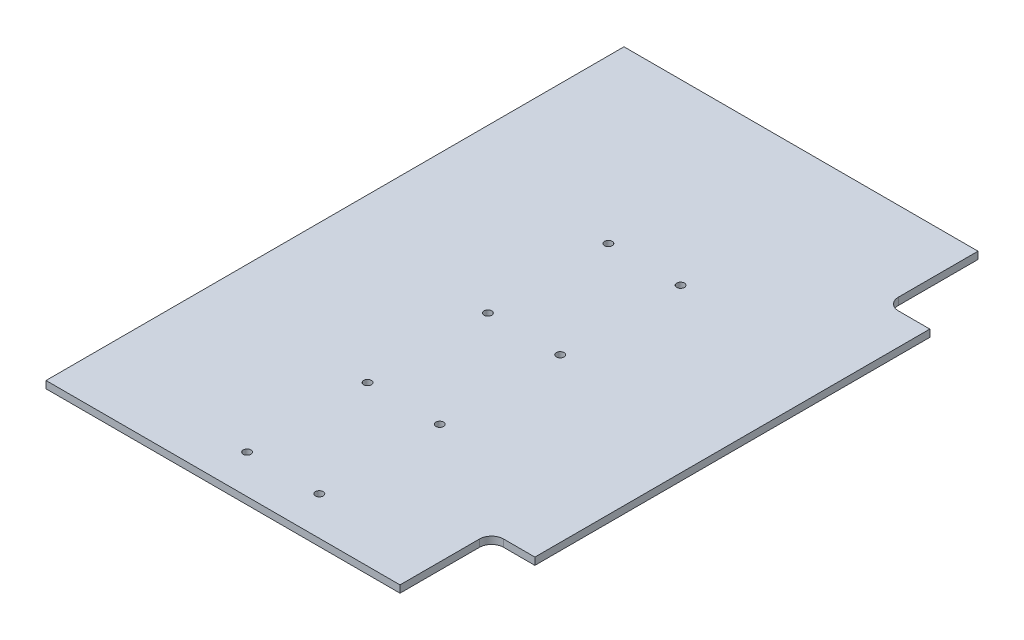
ISO-10303-21;
HEADER;
FILE_DESCRIPTION(('STEP AP214'),'2;1');
FILE_NAME('part.step','',(''),(''),'','','');
FILE_SCHEMA(('AUTOMOTIVE_DESIGN { 1 0 10303 214 1 1 1 1 }'));
ENDSEC;
DATA;
#1=APPLICATION_CONTEXT('core data for automotive mechanical design processes');
#2=APPLICATION_PROTOCOL_DEFINITION('international standard','automotive_design',2000,#1);
#3=PRODUCT_CONTEXT('',#1,'mechanical');
#4=PRODUCT('Part','Part','',(#3));
#5=PRODUCT_RELATED_PRODUCT_CATEGORY('part','',(#4));
#6=PRODUCT_DEFINITION_FORMATION('','',#4);
#7=PRODUCT_DEFINITION_CONTEXT('part definition',#1,'design');
#8=PRODUCT_DEFINITION('design','',#6,#7);
#9=PRODUCT_DEFINITION_SHAPE('','',#8);
#10=(LENGTH_UNIT() NAMED_UNIT(*) SI_UNIT(.MILLI.,.METRE.));
#11=(NAMED_UNIT(*) PLANE_ANGLE_UNIT() SI_UNIT($,.RADIAN.));
#12=(NAMED_UNIT(*) SI_UNIT($,.STERADIAN.) SOLID_ANGLE_UNIT());
#13=UNCERTAINTY_MEASURE_WITH_UNIT(LENGTH_MEASURE(1.E-05),#10,'distance_accuracy_value','');
#14=(GEOMETRIC_REPRESENTATION_CONTEXT(3) GLOBAL_UNCERTAINTY_ASSIGNED_CONTEXT((#13)) GLOBAL_UNIT_ASSIGNED_CONTEXT((#10,
#11,#12)) REPRESENTATION_CONTEXT('',''));
#15=CARTESIAN_POINT('',(0.,0.,0.));
#16=DIRECTION('',(0.,0.,1.));
#17=DIRECTION('',(1.,0.,0.));
#18=AXIS2_PLACEMENT_3D('',#15,#16,#17);
#19=CARTESIAN_POINT('',(82.5,3.,-120.));
#20=DIRECTION('',(-1.,0.,0.));
#21=DIRECTION('',(0.,0.,1.));
#22=AXIS2_PLACEMENT_3D('',#19,#20,#21);
#23=PLANE('',#22);
#24=DIRECTION('',(0.,0.,-1.));
#25=VECTOR('',#24,1.);
#26=CARTESIAN_POINT('',(82.5,0.,-120.));
#27=LINE('',#26,#25);
#28=CARTESIAN_POINT('',(82.4999999999999,0.,82.));
#29=VERTEX_POINT('',#28);
#30=CARTESIAN_POINT('',(82.5,0.,-82.));
#31=VERTEX_POINT('',#30);
#32=EDGE_CURVE('E140',#29,#31,#27,.T.);
#33=ORIENTED_EDGE('',*,*,#32,.T.);
#34=DIRECTION('',(0.,1.,0.));
#35=VECTOR('',#34,1.);
#36=CARTESIAN_POINT('',(82.5,-8.,-82.));
#37=LINE('',#36,#35);
#38=CARTESIAN_POINT('',(82.5,3.,-82.));
#39=VERTEX_POINT('',#38);
#40=EDGE_CURVE('E114',#31,#39,#37,.T.);
#41=ORIENTED_EDGE('',*,*,#40,.T.);
#42=DIRECTION('',(0.,0.,-1.));
#43=VECTOR('',#42,1.);
#44=CARTESIAN_POINT('',(82.5,3.,-120.));
#45=LINE('',#44,#43);
#46=CARTESIAN_POINT('',(82.4999999999999,3.,82.));
#47=VERTEX_POINT('',#46);
#48=EDGE_CURVE('E128',#47,#39,#45,.T.);
#49=ORIENTED_EDGE('',*,*,#48,.F.);
#50=DIRECTION('',(0.,1.,0.));
#51=VECTOR('',#50,1.);
#52=CARTESIAN_POINT('',(82.4999999999999,-8.,82.));
#53=LINE('',#52,#51);
#54=EDGE_CURVE('E220',#29,#47,#53,.T.);
#55=ORIENTED_EDGE('',*,*,#54,.F.);
#56=EDGE_LOOP('',(#33,#41,#49,#55));
#57=FACE_BOUND('',#56,.T.);
#58=ADVANCED_FACE('F33',(#57),#23,.F.);
#59=CARTESIAN_POINT('',(-82.5,3.,-120.));
#60=DIRECTION('',(0.,0.,1.));
#61=DIRECTION('',(1.,0.,0.));
#62=AXIS2_PLACEMENT_3D('',#59,#60,#61);
#63=PLANE('',#62);
#64=DIRECTION('',(-1.,0.,0.));
#65=VECTOR('',#64,1.);
#66=CARTESIAN_POINT('',(-82.5,3.,-120.));
#67=LINE('',#66,#65);
#68=CARTESIAN_POINT('',(64.5,3.,-120.));
#69=VERTEX_POINT('',#68);
#70=CARTESIAN_POINT('',(-82.5,3.,-120.));
#71=VERTEX_POINT('',#70);
#72=EDGE_CURVE('E119',#69,#71,#67,.T.);
#73=ORIENTED_EDGE('',*,*,#72,.F.);
#74=DIRECTION('',(0.,1.,0.));
#75=VECTOR('',#74,1.);
#76=CARTESIAN_POINT('',(64.5,-8.,-120.));
#77=LINE('',#76,#75);
#78=CARTESIAN_POINT('',(64.5,0.,-120.));
#79=VERTEX_POINT('',#78);
#80=EDGE_CURVE('E107',#79,#69,#77,.T.);
#81=ORIENTED_EDGE('',*,*,#80,.F.);
#82=DIRECTION('',(-1.,0.,0.));
#83=VECTOR('',#82,1.);
#84=CARTESIAN_POINT('',(-82.5,0.,-120.));
#85=LINE('',#84,#83);
#86=CARTESIAN_POINT('',(-82.5,0.,-120.));
#87=VERTEX_POINT('',#86);
#88=EDGE_CURVE('E143',#79,#87,#85,.T.);
#89=ORIENTED_EDGE('',*,*,#88,.T.);
#90=DIRECTION('',(0.,-1.,0.));
#91=VECTOR('',#90,1.);
#92=CARTESIAN_POINT('',(-82.5,3.,-120.));
#93=LINE('',#92,#91);
#94=EDGE_CURVE('E125',#71,#87,#93,.T.);
#95=ORIENTED_EDGE('',*,*,#94,.F.);
#96=EDGE_LOOP('',(#73,#81,#89,#95));
#97=FACE_BOUND('',#96,.T.);
#98=ADVANCED_FACE('F123',(#97),#63,.F.);
#99=CARTESIAN_POINT('',(-82.5,3.,-120.));
#100=DIRECTION('',(1.,0.,0.));
#101=DIRECTION('',(0.,0.,-1.));
#102=AXIS2_PLACEMENT_3D('',#99,#100,#101);
#103=PLANE('',#102);
#104=DIRECTION('',(0.,0.,1.));
#105=VECTOR('',#104,1.);
#106=CARTESIAN_POINT('',(-82.5,0.,-120.));
#107=LINE('',#106,#105);
#108=CARTESIAN_POINT('',(-82.5,0.,120.));
#109=VERTEX_POINT('',#108);
#110=EDGE_CURVE('E146',#87,#109,#107,.T.);
#111=ORIENTED_EDGE('',*,*,#110,.T.);
#112=DIRECTION('',(0.,-1.,0.));
#113=VECTOR('',#112,1.);
#114=CARTESIAN_POINT('',(-82.5,3.,120.));
#115=LINE('',#114,#113);
#116=CARTESIAN_POINT('',(-82.5,3.,120.));
#117=VERTEX_POINT('',#116);
#118=EDGE_CURVE('E139',#117,#109,#115,.T.);
#119=ORIENTED_EDGE('',*,*,#118,.F.);
#120=DIRECTION('',(0.,0.,1.));
#121=VECTOR('',#120,1.);
#122=CARTESIAN_POINT('',(-82.5,3.,-120.));
#123=LINE('',#122,#121);
#124=EDGE_CURVE('E127',#71,#117,#123,.T.);
#125=ORIENTED_EDGE('',*,*,#124,.F.);
#126=ORIENTED_EDGE('',*,*,#94,.T.);
#127=EDGE_LOOP('',(#111,#119,#125,#126));
#128=FACE_BOUND('',#127,.T.);
#129=ADVANCED_FACE('F262',(#128),#103,.F.);
#130=CARTESIAN_POINT('',(-82.5,3.,120.));
#131=DIRECTION('',(0.,0.,-1.));
#132=DIRECTION('',(-1.,0.,0.));
#133=AXIS2_PLACEMENT_3D('',#130,#131,#132);
#134=PLANE('',#133);
#135=DIRECTION('',(1.,0.,0.));
#136=VECTOR('',#135,1.);
#137=CARTESIAN_POINT('',(-82.5,0.,120.));
#138=LINE('',#137,#136);
#139=CARTESIAN_POINT('',(64.5,0.,120.));
#140=VERTEX_POINT('',#139);
#141=EDGE_CURVE('E133',#109,#140,#138,.T.);
#142=ORIENTED_EDGE('',*,*,#141,.T.);
#143=DIRECTION('',(0.,1.,0.));
#144=VECTOR('',#143,1.);
#145=CARTESIAN_POINT('',(64.5,-8.,120.));
#146=LINE('',#145,#144);
#147=CARTESIAN_POINT('',(64.5,3.,120.));
#148=VERTEX_POINT('',#147);
#149=EDGE_CURVE('E121',#140,#148,#146,.T.);
#150=ORIENTED_EDGE('',*,*,#149,.T.);
#151=DIRECTION('',(1.,0.,0.));
#152=VECTOR('',#151,1.);
#153=CARTESIAN_POINT('',(-82.5,3.,120.));
#154=LINE('',#153,#152);
#155=EDGE_CURVE('E130',#117,#148,#154,.T.);
#156=ORIENTED_EDGE('',*,*,#155,.F.);
#157=ORIENTED_EDGE('',*,*,#118,.T.);
#158=EDGE_LOOP('',(#142,#150,#156,#157));
#159=FACE_BOUND('',#158,.T.);
#160=ADVANCED_FACE('F254',(#159),#134,.F.);
#161=CARTESIAN_POINT('',(0.,3.,0.));
#162=DIRECTION('',(0.,1.,0.));
#163=DIRECTION('',(0.,0.,1.));
#164=AXIS2_PLACEMENT_3D('',#161,#162,#163);
#165=PLANE('',#164);
#166=DIRECTION('',(1.,0.,0.));
#167=VECTOR('',#166,1.);
#168=CARTESIAN_POINT('',(82.5,3.,-82.));
#169=LINE('',#168,#167);
#170=CARTESIAN_POINT('',(69.5,3.,-82.));
#171=VERTEX_POINT('',#170);
#172=EDGE_CURVE('E115',#171,#39,#169,.T.);
#173=ORIENTED_EDGE('',*,*,#172,.F.);
#174=CARTESIAN_POINT('',(69.5,3.,-87.));
#175=DIRECTION('',(0.,1.,0.));
#176=DIRECTION('',(0.,0.,1.));
#177=AXIS2_PLACEMENT_3D('',#174,#175,#176);
#178=CIRCLE('',#177,5.);
#179=CARTESIAN_POINT('',(64.5,3.,-87.));
#180=VERTEX_POINT('',#179);
#181=EDGE_CURVE('E41',#171,#180,#178,.F.);
#182=ORIENTED_EDGE('',*,*,#181,.T.);
#183=DIRECTION('',(0.,0.,1.));
#184=VECTOR('',#183,1.);
#185=CARTESIAN_POINT('',(64.5,3.,-120.));
#186=LINE('',#185,#184);
#187=EDGE_CURVE('E109',#69,#180,#186,.T.);
#188=ORIENTED_EDGE('',*,*,#187,.F.);
#189=ORIENTED_EDGE('',*,*,#72,.T.);
#190=ORIENTED_EDGE('',*,*,#124,.T.);
#191=ORIENTED_EDGE('',*,*,#155,.T.);
#192=DIRECTION('',(0.,0.,1.));
#193=VECTOR('',#192,1.);
#194=CARTESIAN_POINT('',(64.5,3.,120.));
#195=LINE('',#194,#193);
#196=CARTESIAN_POINT('',(64.5,3.,87.));
#197=VERTEX_POINT('',#196);
#198=EDGE_CURVE('E216',#197,#148,#195,.T.);
#199=ORIENTED_EDGE('',*,*,#198,.F.);
#200=CARTESIAN_POINT('',(69.5,3.,87.));
#201=DIRECTION('',(0.,1.,0.));
#202=DIRECTION('',(0.,0.,1.));
#203=AXIS2_PLACEMENT_3D('',#200,#201,#202);
#204=CIRCLE('',#203,5.);
#205=CARTESIAN_POINT('',(69.5,3.,82.));
#206=VERTEX_POINT('',#205);
#207=EDGE_CURVE('E194',#197,#206,#204,.F.);
#208=ORIENTED_EDGE('',*,*,#207,.T.);
#209=DIRECTION('',(-1.,0.,0.));
#210=VECTOR('',#209,1.);
#211=CARTESIAN_POINT('',(82.4999999999999,3.,82.));
#212=LINE('',#211,#210);
#213=EDGE_CURVE('E214',#47,#206,#212,.T.);
#214=ORIENTED_EDGE('',*,*,#213,.F.);
#215=ORIENTED_EDGE('',*,*,#48,.T.);
#216=EDGE_LOOP('',(#173,#182,#188,#189,#190,#191,#199,#208,#214,#215));
#217=FACE_BOUND('',#216,.T.);
#218=CARTESIAN_POINT('',(15.000000000001,3.,54.));
#219=DIRECTION('',(0.,1.,0.));
#220=DIRECTION('',(0.,0.,1.));
#221=AXIS2_PLACEMENT_3D('',#218,#219,#220);
#222=CIRCLE('',#221,1.6);
#223=CARTESIAN_POINT('',(15.000000000001,3.,55.6));
#224=VERTEX_POINT('',#223);
#225=EDGE_CURVE('E234',#224,#224,#222,.T.);
#226=ORIENTED_EDGE('',*,*,#225,.F.);
#227=EDGE_LOOP('',(#226));
#228=FACE_BOUND('',#227,.T.);
#229=CARTESIAN_POINT('',(-14.9999999999995,3.,4.00000000000003));
#230=DIRECTION('',(0.,1.,0.));
#231=DIRECTION('',(0.,0.,1.));
#232=AXIS2_PLACEMENT_3D('',#229,#230,#231);
#233=CIRCLE('',#232,1.6);
#234=CARTESIAN_POINT('',(-14.9999999999995,3.,5.60000000000003));
#235=VERTEX_POINT('',#234);
#236=EDGE_CURVE('E237',#235,#235,#233,.T.);
#237=ORIENTED_EDGE('',*,*,#236,.F.);
#238=EDGE_LOOP('',(#237));
#239=FACE_BOUND('',#238,.T.);
#240=CARTESIAN_POINT('',(15.0000000000005,3.,4.00000000000003));
#241=DIRECTION('',(0.,1.,0.));
#242=DIRECTION('',(0.,0.,1.));
#243=AXIS2_PLACEMENT_3D('',#240,#241,#242);
#244=CIRCLE('',#243,1.6);
#245=CARTESIAN_POINT('',(15.0000000000005,3.,5.60000000000003));
#246=VERTEX_POINT('',#245);
#247=EDGE_CURVE('E240',#246,#246,#244,.T.);
#248=ORIENTED_EDGE('',*,*,#247,.F.);
#249=EDGE_LOOP('',(#248));
#250=FACE_BOUND('',#249,.T.);
#251=CARTESIAN_POINT('',(-15.,3.,-46.));
#252=DIRECTION('',(0.,1.,0.));
#253=DIRECTION('',(0.,0.,1.));
#254=AXIS2_PLACEMENT_3D('',#251,#252,#253);
#255=CIRCLE('',#254,1.6);
#256=CARTESIAN_POINT('',(-15.,3.,-44.4));
#257=VERTEX_POINT('',#256);
#258=EDGE_CURVE('E243',#257,#257,#255,.T.);
#259=ORIENTED_EDGE('',*,*,#258,.F.);
#260=EDGE_LOOP('',(#259));
#261=FACE_BOUND('',#260,.T.);
#262=CARTESIAN_POINT('',(-14.9999999999984,3.,104.));
#263=DIRECTION('',(0.,1.,0.));
#264=DIRECTION('',(0.,0.,1.));
#265=AXIS2_PLACEMENT_3D('',#262,#263,#264);
#266=CIRCLE('',#265,1.6);
#267=CARTESIAN_POINT('',(-14.9999999999984,3.,105.6));
#268=VERTEX_POINT('',#267);
#269=EDGE_CURVE('E227',#268,#268,#266,.T.);
#270=ORIENTED_EDGE('',*,*,#269,.F.);
#271=EDGE_LOOP('',(#270));
#272=FACE_BOUND('',#271,.T.);
#273=CARTESIAN_POINT('',(15.0000000000016,3.,104.));
#274=DIRECTION('',(0.,1.,0.));
#275=DIRECTION('',(0.,0.,1.));
#276=AXIS2_PLACEMENT_3D('',#273,#274,#275);
#277=CIRCLE('',#276,1.6);
#278=CARTESIAN_POINT('',(15.0000000000016,3.,105.6));
#279=VERTEX_POINT('',#278);
#280=EDGE_CURVE('E230',#279,#279,#277,.T.);
#281=ORIENTED_EDGE('',*,*,#280,.F.);
#282=EDGE_LOOP('',(#281));
#283=FACE_BOUND('',#282,.T.);
#284=CARTESIAN_POINT('',(-14.999999999999,3.,54.));
#285=DIRECTION('',(0.,1.,0.));
#286=DIRECTION('',(0.,0.,1.));
#287=AXIS2_PLACEMENT_3D('',#284,#285,#286);
#288=CIRCLE('',#287,1.6);
#289=CARTESIAN_POINT('',(-14.999999999999,3.,55.6));
#290=VERTEX_POINT('',#289);
#291=EDGE_CURVE('E231',#290,#290,#288,.T.);
#292=ORIENTED_EDGE('',*,*,#291,.F.);
#293=EDGE_LOOP('',(#292));
#294=FACE_BOUND('',#293,.T.);
#295=CARTESIAN_POINT('',(15.,3.,-46.));
#296=DIRECTION('',(0.,1.,0.));
#297=DIRECTION('',(0.,0.,1.));
#298=AXIS2_PLACEMENT_3D('',#295,#296,#297);
#299=CIRCLE('',#298,1.6);
#300=CARTESIAN_POINT('',(15.,3.,-44.4));
#301=VERTEX_POINT('',#300);
#302=EDGE_CURVE('E158',#301,#301,#299,.T.);
#303=ORIENTED_EDGE('',*,*,#302,.F.);
#304=EDGE_LOOP('',(#303));
#305=FACE_BOUND('',#304,.T.);
#306=ADVANCED_FACE('F117',(#217,#228,#239,#250,#261,#272,#283,#294,#305),#165,.T.);
#307=CARTESIAN_POINT('',(0.,0.,0.));
#308=DIRECTION('',(0.,1.,0.));
#309=DIRECTION('',(0.,0.,1.));
#310=AXIS2_PLACEMENT_3D('',#307,#308,#309);
#311=PLANE('',#310);
#312=CARTESIAN_POINT('',(15.000000000001,0.,54.));
#313=DIRECTION('',(0.,1.,0.));
#314=DIRECTION('',(0.,0.,1.));
#315=AXIS2_PLACEMENT_3D('',#312,#313,#314);
#316=CIRCLE('',#315,1.6);
#317=CARTESIAN_POINT('',(15.000000000001,0.,55.6));
#318=VERTEX_POINT('',#317);
#319=EDGE_CURVE('E144',#318,#318,#316,.T.);
#320=ORIENTED_EDGE('',*,*,#319,.T.);
#321=EDGE_LOOP('',(#320));
#322=FACE_BOUND('',#321,.T.);
#323=CARTESIAN_POINT('',(-14.9999999999995,0.,4.00000000000003));
#324=DIRECTION('',(0.,1.,0.));
#325=DIRECTION('',(0.,0.,1.));
#326=AXIS2_PLACEMENT_3D('',#323,#324,#325);
#327=CIRCLE('',#326,1.6);
#328=CARTESIAN_POINT('',(-14.9999999999995,0.,5.60000000000003));
#329=VERTEX_POINT('',#328);
#330=EDGE_CURVE('E173',#329,#329,#327,.T.);
#331=ORIENTED_EDGE('',*,*,#330,.T.);
#332=EDGE_LOOP('',(#331));
#333=FACE_BOUND('',#332,.T.);
#334=CARTESIAN_POINT('',(15.0000000000005,0.,4.00000000000003));
#335=DIRECTION('',(0.,1.,0.));
#336=DIRECTION('',(0.,0.,1.));
#337=AXIS2_PLACEMENT_3D('',#334,#335,#336);
#338=CIRCLE('',#337,1.6);
#339=CARTESIAN_POINT('',(15.0000000000005,0.,5.60000000000003));
#340=VERTEX_POINT('',#339);
#341=EDGE_CURVE('E170',#340,#340,#338,.T.);
#342=ORIENTED_EDGE('',*,*,#341,.T.);
#343=EDGE_LOOP('',(#342));
#344=FACE_BOUND('',#343,.T.);
#345=CARTESIAN_POINT('',(-15.,0.,-46.));
#346=DIRECTION('',(0.,1.,0.));
#347=DIRECTION('',(0.,0.,1.));
#348=AXIS2_PLACEMENT_3D('',#345,#346,#347);
#349=CIRCLE('',#348,1.6);
#350=CARTESIAN_POINT('',(-15.,0.,-44.4));
#351=VERTEX_POINT('',#350);
#352=EDGE_CURVE('E167',#351,#351,#349,.T.);
#353=ORIENTED_EDGE('',*,*,#352,.T.);
#354=EDGE_LOOP('',(#353));
#355=FACE_BOUND('',#354,.T.);
#356=CARTESIAN_POINT('',(-14.9999999999984,0.,104.));
#357=DIRECTION('',(0.,1.,0.));
#358=DIRECTION('',(0.,0.,1.));
#359=AXIS2_PLACEMENT_3D('',#356,#357,#358);
#360=CIRCLE('',#359,1.6);
#361=CARTESIAN_POINT('',(-14.9999999999984,0.,105.6));
#362=VERTEX_POINT('',#361);
#363=EDGE_CURVE('E164',#362,#362,#360,.T.);
#364=ORIENTED_EDGE('',*,*,#363,.T.);
#365=EDGE_LOOP('',(#364));
#366=FACE_BOUND('',#365,.T.);
#367=CARTESIAN_POINT('',(15.0000000000016,0.,104.));
#368=DIRECTION('',(0.,1.,0.));
#369=DIRECTION('',(0.,0.,1.));
#370=AXIS2_PLACEMENT_3D('',#367,#368,#369);
#371=CIRCLE('',#370,1.6);
#372=CARTESIAN_POINT('',(15.0000000000016,0.,105.6));
#373=VERTEX_POINT('',#372);
#374=EDGE_CURVE('E161',#373,#373,#371,.T.);
#375=ORIENTED_EDGE('',*,*,#374,.T.);
#376=EDGE_LOOP('',(#375));
#377=FACE_BOUND('',#376,.T.);
#378=CARTESIAN_POINT('',(-14.999999999999,0.,54.));
#379=DIRECTION('',(0.,1.,0.));
#380=DIRECTION('',(0.,0.,1.));
#381=AXIS2_PLACEMENT_3D('',#378,#379,#380);
#382=CIRCLE('',#381,1.6);
#383=CARTESIAN_POINT('',(-14.999999999999,0.,55.6));
#384=VERTEX_POINT('',#383);
#385=EDGE_CURVE('E157',#384,#384,#382,.T.);
#386=ORIENTED_EDGE('',*,*,#385,.T.);
#387=EDGE_LOOP('',(#386));
#388=FACE_BOUND('',#387,.T.);
#389=CARTESIAN_POINT('',(15.,0.,-46.));
#390=DIRECTION('',(0.,1.,0.));
#391=DIRECTION('',(0.,0.,1.));
#392=AXIS2_PLACEMENT_3D('',#389,#390,#391);
#393=CIRCLE('',#392,1.6);
#394=CARTESIAN_POINT('',(15.,0.,-44.4));
#395=VERTEX_POINT('',#394);
#396=EDGE_CURVE('E154',#395,#395,#393,.T.);
#397=ORIENTED_EDGE('',*,*,#396,.T.);
#398=EDGE_LOOP('',(#397));
#399=FACE_BOUND('',#398,.T.);
#400=DIRECTION('',(0.,0.,1.));
#401=VECTOR('',#400,1.);
#402=CARTESIAN_POINT('',(64.4999999999999,0.,0.));
#403=LINE('',#402,#401);
#404=CARTESIAN_POINT('',(64.5,0.,-87.));
#405=VERTEX_POINT('',#404);
#406=EDGE_CURVE('E110',#79,#405,#403,.T.);
#407=ORIENTED_EDGE('',*,*,#406,.T.);
#408=CARTESIAN_POINT('',(69.5,0.,-87.));
#409=DIRECTION('',(0.,1.,0.));
#410=DIRECTION('',(0.,0.,1.));
#411=AXIS2_PLACEMENT_3D('',#408,#409,#410);
#412=CIRCLE('',#411,5.);
#413=CARTESIAN_POINT('',(69.5,0.,-82.));
#414=VERTEX_POINT('',#413);
#415=EDGE_CURVE('E11',#405,#414,#412,.T.);
#416=ORIENTED_EDGE('',*,*,#415,.T.);
#417=DIRECTION('',(1.,0.,0.));
#418=VECTOR('',#417,1.);
#419=CARTESIAN_POINT('',(0.,0.,-82.));
#420=LINE('',#419,#418);
#421=EDGE_CURVE('E183',#414,#31,#420,.T.);
#422=ORIENTED_EDGE('',*,*,#421,.T.);
#423=ORIENTED_EDGE('',*,*,#32,.F.);
#424=DIRECTION('',(-1.,0.,0.));
#425=VECTOR('',#424,1.);
#426=CARTESIAN_POINT('',(-1.26442066693421E-13,0.,81.9999999999999));
#427=LINE('',#426,#425);
#428=CARTESIAN_POINT('',(69.5,0.,82.));
#429=VERTEX_POINT('',#428);
#430=EDGE_CURVE('E153',#29,#429,#427,.T.);
#431=ORIENTED_EDGE('',*,*,#430,.T.);
#432=CARTESIAN_POINT('',(69.5,0.,87.));
#433=DIRECTION('',(0.,1.,0.));
#434=DIRECTION('',(0.,0.,1.));
#435=AXIS2_PLACEMENT_3D('',#432,#433,#434);
#436=CIRCLE('',#435,5.);
#437=CARTESIAN_POINT('',(64.5,0.,87.));
#438=VERTEX_POINT('',#437);
#439=EDGE_CURVE('E196',#429,#438,#436,.T.);
#440=ORIENTED_EDGE('',*,*,#439,.T.);
#441=DIRECTION('',(0.,0.,1.));
#442=VECTOR('',#441,1.);
#443=CARTESIAN_POINT('',(64.5,0.,0.));
#444=LINE('',#443,#442);
#445=EDGE_CURVE('E180',#438,#140,#444,.T.);
#446=ORIENTED_EDGE('',*,*,#445,.T.);
#447=ORIENTED_EDGE('',*,*,#141,.F.);
#448=ORIENTED_EDGE('',*,*,#110,.F.);
#449=ORIENTED_EDGE('',*,*,#88,.F.);
#450=EDGE_LOOP('',(#407,#416,#422,#423,#431,#440,#446,#447,#448,#449));
#451=FACE_BOUND('',#450,.T.);
#452=ADVANCED_FACE('F200',(#322,#333,#344,#355,#366,#377,#388,#399,#451),#311,.F.);
#453=CARTESIAN_POINT('',(15.,-8.,-46.));
#454=DIRECTION('',(0.,1.,0.));
#455=DIRECTION('',(0.,0.,1.));
#456=AXIS2_PLACEMENT_3D('',#453,#454,#455);
#457=CYLINDRICAL_SURFACE('',#456,1.6);
#458=ORIENTED_EDGE('',*,*,#302,.T.);
#459=EDGE_LOOP('',(#458));
#460=FACE_BOUND('',#459,.T.);
#461=ORIENTED_EDGE('',*,*,#396,.F.);
#462=EDGE_LOOP('',(#461));
#463=FACE_BOUND('',#462,.T.);
#464=ADVANCED_FACE('F250',(#460,#463),#457,.F.);
#465=CARTESIAN_POINT('',(-14.999999999999,-8.,54.));
#466=DIRECTION('',(0.,1.,0.));
#467=DIRECTION('',(0.,0.,1.));
#468=AXIS2_PLACEMENT_3D('',#465,#466,#467);
#469=CYLINDRICAL_SURFACE('',#468,1.6);
#470=ORIENTED_EDGE('',*,*,#291,.T.);
#471=EDGE_LOOP('',(#470));
#472=FACE_BOUND('',#471,.T.);
#473=ORIENTED_EDGE('',*,*,#385,.F.);
#474=EDGE_LOOP('',(#473));
#475=FACE_BOUND('',#474,.T.);
#476=ADVANCED_FACE('F299',(#472,#475),#469,.F.);
#477=CARTESIAN_POINT('',(15.0000000000016,-8.,104.));
#478=DIRECTION('',(0.,1.,0.));
#479=DIRECTION('',(0.,0.,1.));
#480=AXIS2_PLACEMENT_3D('',#477,#478,#479);
#481=CYLINDRICAL_SURFACE('',#480,1.6);
#482=ORIENTED_EDGE('',*,*,#280,.T.);
#483=EDGE_LOOP('',(#482));
#484=FACE_BOUND('',#483,.T.);
#485=ORIENTED_EDGE('',*,*,#374,.F.);
#486=EDGE_LOOP('',(#485));
#487=FACE_BOUND('',#486,.T.);
#488=ADVANCED_FACE('F297',(#484,#487),#481,.F.);
#489=CARTESIAN_POINT('',(-14.9999999999984,-8.,104.));
#490=DIRECTION('',(0.,1.,0.));
#491=DIRECTION('',(0.,0.,1.));
#492=AXIS2_PLACEMENT_3D('',#489,#490,#491);
#493=CYLINDRICAL_SURFACE('',#492,1.6);
#494=ORIENTED_EDGE('',*,*,#269,.T.);
#495=EDGE_LOOP('',(#494));
#496=FACE_BOUND('',#495,.T.);
#497=ORIENTED_EDGE('',*,*,#363,.F.);
#498=EDGE_LOOP('',(#497));
#499=FACE_BOUND('',#498,.T.);
#500=ADVANCED_FACE('F293',(#496,#499),#493,.F.);
#501=CARTESIAN_POINT('',(-15.,-8.,-46.));
#502=DIRECTION('',(0.,1.,0.));
#503=DIRECTION('',(0.,0.,1.));
#504=AXIS2_PLACEMENT_3D('',#501,#502,#503);
#505=CYLINDRICAL_SURFACE('',#504,1.6);
#506=ORIENTED_EDGE('',*,*,#258,.T.);
#507=EDGE_LOOP('',(#506));
#508=FACE_BOUND('',#507,.T.);
#509=ORIENTED_EDGE('',*,*,#352,.F.);
#510=EDGE_LOOP('',(#509));
#511=FACE_BOUND('',#510,.T.);
#512=ADVANCED_FACE('F296',(#508,#511),#505,.F.);
#513=CARTESIAN_POINT('',(15.0000000000005,-8.,4.00000000000003));
#514=DIRECTION('',(0.,1.,0.));
#515=DIRECTION('',(0.,0.,1.));
#516=AXIS2_PLACEMENT_3D('',#513,#514,#515);
#517=CYLINDRICAL_SURFACE('',#516,1.6);
#518=ORIENTED_EDGE('',*,*,#247,.T.);
#519=EDGE_LOOP('',(#518));
#520=FACE_BOUND('',#519,.T.);
#521=ORIENTED_EDGE('',*,*,#341,.F.);
#522=EDGE_LOOP('',(#521));
#523=FACE_BOUND('',#522,.T.);
#524=ADVANCED_FACE('F309',(#520,#523),#517,.F.);
#525=CARTESIAN_POINT('',(-14.9999999999995,-8.,4.00000000000003));
#526=DIRECTION('',(0.,1.,0.));
#527=DIRECTION('',(0.,0.,1.));
#528=AXIS2_PLACEMENT_3D('',#525,#526,#527);
#529=CYLINDRICAL_SURFACE('',#528,1.6);
#530=ORIENTED_EDGE('',*,*,#236,.T.);
#531=EDGE_LOOP('',(#530));
#532=FACE_BOUND('',#531,.T.);
#533=ORIENTED_EDGE('',*,*,#330,.F.);
#534=EDGE_LOOP('',(#533));
#535=FACE_BOUND('',#534,.T.);
#536=ADVANCED_FACE('F306',(#532,#535),#529,.F.);
#537=CARTESIAN_POINT('',(15.000000000001,-8.,54.));
#538=DIRECTION('',(0.,1.,0.));
#539=DIRECTION('',(0.,0.,1.));
#540=AXIS2_PLACEMENT_3D('',#537,#538,#539);
#541=CYLINDRICAL_SURFACE('',#540,1.6);
#542=ORIENTED_EDGE('',*,*,#225,.T.);
#543=EDGE_LOOP('',(#542));
#544=FACE_BOUND('',#543,.T.);
#545=ORIENTED_EDGE('',*,*,#319,.F.);
#546=EDGE_LOOP('',(#545));
#547=FACE_BOUND('',#546,.T.);
#548=ADVANCED_FACE('F290',(#544,#547),#541,.F.);
#549=CARTESIAN_POINT('',(64.5,-8.,120.));
#550=DIRECTION('',(-1.,0.,0.));
#551=DIRECTION('',(0.,0.,1.));
#552=AXIS2_PLACEMENT_3D('',#549,#550,#551);
#553=PLANE('',#552);
#554=ORIENTED_EDGE('',*,*,#445,.F.);
#555=DIRECTION('',(0.,1.,0.));
#556=VECTOR('',#555,1.);
#557=CARTESIAN_POINT('',(64.5,3.,87.));
#558=LINE('',#557,#556);
#559=EDGE_CURVE('E185',#438,#197,#558,.T.);
#560=ORIENTED_EDGE('',*,*,#559,.T.);
#561=ORIENTED_EDGE('',*,*,#198,.T.);
#562=ORIENTED_EDGE('',*,*,#149,.F.);
#563=EDGE_LOOP('',(#554,#560,#561,#562));
#564=FACE_BOUND('',#563,.T.);
#565=ADVANCED_FACE('F208',(#564),#553,.F.);
#566=CARTESIAN_POINT('',(82.4999999999999,-8.,82.));
#567=DIRECTION('',(0.,0.,-1.));
#568=DIRECTION('',(-1.,0.,0.));
#569=AXIS2_PLACEMENT_3D('',#566,#567,#568);
#570=PLANE('',#569);
#571=ORIENTED_EDGE('',*,*,#213,.T.);
#572=DIRECTION('',(0.,1.,0.));
#573=VECTOR('',#572,1.);
#574=CARTESIAN_POINT('',(69.5,0.,82.));
#575=LINE('',#574,#573);
#576=EDGE_CURVE('E188',#206,#429,#575,.F.);
#577=ORIENTED_EDGE('',*,*,#576,.T.);
#578=ORIENTED_EDGE('',*,*,#430,.F.);
#579=ORIENTED_EDGE('',*,*,#54,.T.);
#580=EDGE_LOOP('',(#571,#577,#578,#579));
#581=FACE_BOUND('',#580,.T.);
#582=ADVANCED_FACE('F218',(#581),#570,.F.);
#583=CARTESIAN_POINT('',(82.5,-8.,-82.));
#584=DIRECTION('',(0.,0.,1.));
#585=DIRECTION('',(1.,0.,0.));
#586=AXIS2_PLACEMENT_3D('',#583,#584,#585);
#587=PLANE('',#586);
#588=ORIENTED_EDGE('',*,*,#421,.F.);
#589=DIRECTION('',(0.,1.,0.));
#590=VECTOR('',#589,1.);
#591=CARTESIAN_POINT('',(69.5,3.,-82.));
#592=LINE('',#591,#590);
#593=EDGE_CURVE('E190',#414,#171,#592,.T.);
#594=ORIENTED_EDGE('',*,*,#593,.T.);
#595=ORIENTED_EDGE('',*,*,#172,.T.);
#596=ORIENTED_EDGE('',*,*,#40,.F.);
#597=EDGE_LOOP('',(#588,#594,#595,#596));
#598=FACE_BOUND('',#597,.T.);
#599=ADVANCED_FACE('F280',(#598),#587,.F.);
#600=CARTESIAN_POINT('',(64.5,-8.,-120.));
#601=DIRECTION('',(-1.,0.,0.));
#602=DIRECTION('',(0.,0.,1.));
#603=AXIS2_PLACEMENT_3D('',#600,#601,#602);
#604=PLANE('',#603);
#605=ORIENTED_EDGE('',*,*,#187,.T.);
#606=DIRECTION('',(0.,1.,0.));
#607=VECTOR('',#606,1.);
#608=CARTESIAN_POINT('',(64.5,0.,-87.));
#609=LINE('',#608,#607);
#610=EDGE_CURVE('E48',#180,#405,#609,.F.);
#611=ORIENTED_EDGE('',*,*,#610,.T.);
#612=ORIENTED_EDGE('',*,*,#406,.F.);
#613=ORIENTED_EDGE('',*,*,#80,.T.);
#614=EDGE_LOOP('',(#605,#611,#612,#613));
#615=FACE_BOUND('',#614,.T.);
#616=ADVANCED_FACE('F108',(#615),#604,.F.);
#617=CARTESIAN_POINT('',(69.5,-8.,87.));
#618=DIRECTION('',(0.,-1.,0.));
#619=DIRECTION('',(0.,0.,-1.));
#620=AXIS2_PLACEMENT_3D('',#617,#618,#619);
#621=CYLINDRICAL_SURFACE('',#620,5.);
#622=ORIENTED_EDGE('',*,*,#439,.F.);
#623=ORIENTED_EDGE('',*,*,#576,.F.);
#624=ORIENTED_EDGE('',*,*,#207,.F.);
#625=ORIENTED_EDGE('',*,*,#559,.F.);
#626=EDGE_LOOP('',(#622,#623,#624,#625));
#627=FACE_BOUND('',#626,.T.);
#628=ADVANCED_FACE('F211',(#627),#621,.F.);
#629=CARTESIAN_POINT('',(69.5,-8.,-87.));
#630=DIRECTION('',(0.,-1.,0.));
#631=DIRECTION('',(0.,0.,-1.));
#632=AXIS2_PLACEMENT_3D('',#629,#630,#631);
#633=CYLINDRICAL_SURFACE('',#632,5.);
#634=ORIENTED_EDGE('',*,*,#415,.F.);
#635=ORIENTED_EDGE('',*,*,#610,.F.);
#636=ORIENTED_EDGE('',*,*,#181,.F.);
#637=ORIENTED_EDGE('',*,*,#593,.F.);
#638=EDGE_LOOP('',(#634,#635,#636,#637));
#639=FACE_BOUND('',#638,.T.);
#640=ADVANCED_FACE('F35',(#639),#633,.F.);
#641=CLOSED_SHELL('',(#58,#98,#129,#160,#306,#452,#464,#476,#488,#500,#512,#524,#536,#548,#565,
#582,#599,#616,#628,#640));
#642=MANIFOLD_SOLID_BREP('B2',#641);
#643=ADVANCED_BREP_SHAPE_REPRESENTATION('',(#18,#642),#14);
#644=SHAPE_DEFINITION_REPRESENTATION(#9,#643);
ENDSEC;
END-ISO-10303-21;
